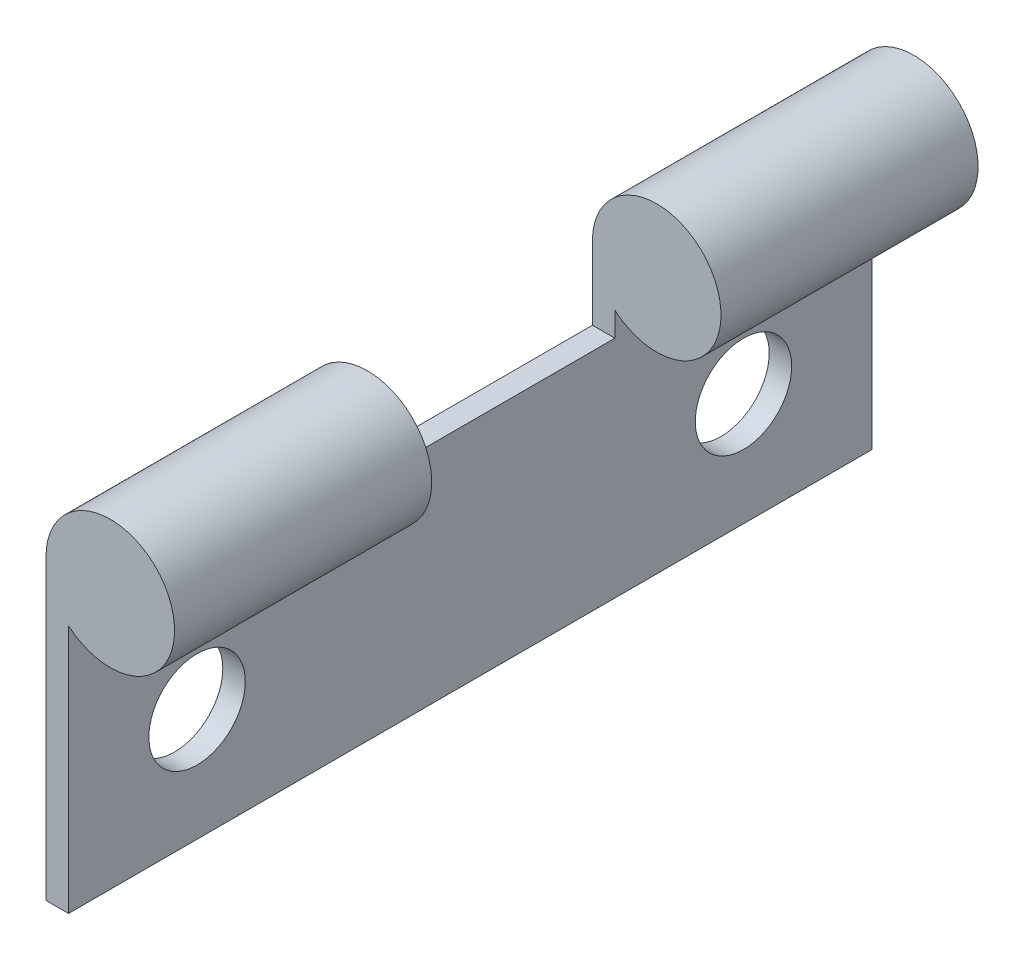
ISO-10303-21;
HEADER;
FILE_DESCRIPTION(('STEP AP214'),'2;1');
FILE_NAME('part.step','',(''),(''),'','','');
FILE_SCHEMA(('AUTOMOTIVE_DESIGN { 1 0 10303 214 1 1 1 1 }'));
ENDSEC;
DATA;
#1=APPLICATION_CONTEXT('core data for automotive mechanical design processes');
#2=APPLICATION_PROTOCOL_DEFINITION('international standard','automotive_design',2000,#1);
#3=PRODUCT_CONTEXT('',#1,'mechanical');
#4=PRODUCT('Part','Part','',(#3));
#5=PRODUCT_RELATED_PRODUCT_CATEGORY('part','',(#4));
#6=PRODUCT_DEFINITION_FORMATION('','',#4);
#7=PRODUCT_DEFINITION_CONTEXT('part definition',#1,'design');
#8=PRODUCT_DEFINITION('design','',#6,#7);
#9=PRODUCT_DEFINITION_SHAPE('','',#8);
#10=(LENGTH_UNIT() NAMED_UNIT(*) SI_UNIT(.MILLI.,.METRE.));
#11=(NAMED_UNIT(*) PLANE_ANGLE_UNIT() SI_UNIT($,.RADIAN.));
#12=(NAMED_UNIT(*) SI_UNIT($,.STERADIAN.) SOLID_ANGLE_UNIT());
#13=UNCERTAINTY_MEASURE_WITH_UNIT(LENGTH_MEASURE(1.E-05),#10,'distance_accuracy_value','');
#14=(GEOMETRIC_REPRESENTATION_CONTEXT(3) GLOBAL_UNCERTAINTY_ASSIGNED_CONTEXT((#13)) GLOBAL_UNIT_ASSIGNED_CONTEXT((#10,
#11,#12)) REPRESENTATION_CONTEXT('',''));
#15=CARTESIAN_POINT('',(0.,0.,0.));
#16=DIRECTION('',(0.,0.,1.));
#17=DIRECTION('',(1.,0.,0.));
#18=AXIS2_PLACEMENT_3D('',#15,#16,#17);
#19=CARTESIAN_POINT('',(0.7,0.,0.));
#20=DIRECTION('',(-1.,0.,0.));
#21=DIRECTION('',(0.,0.,1.));
#22=AXIS2_PLACEMENT_3D('',#19,#20,#21);
#23=PLANE('',#22);
#24=DIRECTION('',(0.,-1.,0.));
#25=VECTOR('',#24,1.);
#26=CARTESIAN_POINT('',(0.7,69.8482632675798,-185.963773135156));
#27=LINE('',#26,#25);
#28=CARTESIAN_POINT('',(0.699999999999995,68.3283948522228,-185.963773135156));
#29=VERTEX_POINT('',#28);
#30=CARTESIAN_POINT('',(0.7,60.5747220858746,-185.963773135156));
#31=VERTEX_POINT('',#30);
#32=EDGE_CURVE('E187',#29,#31,#27,.T.);
#33=ORIENTED_EDGE('',*,*,#32,.F.);
#34=DIRECTION('',(0.,0.,-1.));
#35=VECTOR('',#34,1.);
#36=CARTESIAN_POINT('',(0.7,68.3283948522228,-172.306918885664));
#37=LINE('',#36,#35);
#38=CARTESIAN_POINT('',(0.699999999999995,68.3283948522228,-177.963773135156));
#39=VERTEX_POINT('',#38);
#40=EDGE_CURVE('E172',#29,#39,#37,.F.);
#41=ORIENTED_EDGE('',*,*,#40,.T.);
#42=DIRECTION('',(0.,-1.,0.));
#43=VECTOR('',#42,1.);
#44=CARTESIAN_POINT('',(0.7,69.8482632675798,-177.963773135156));
#45=LINE('',#44,#43);
#46=CARTESIAN_POINT('',(0.7,67.5747220858746,-177.963773135156));
#47=VERTEX_POINT('',#46);
#48=EDGE_CURVE('E184',#39,#47,#45,.T.);
#49=ORIENTED_EDGE('',*,*,#48,.T.);
#50=DIRECTION('',(0.,0.,-1.));
#51=VECTOR('',#50,1.);
#52=CARTESIAN_POINT('',(0.7,67.5747220858746,-168.963773135156));
#53=LINE('',#52,#51);
#54=CARTESIAN_POINT('',(0.7,67.5747220858746,-168.963773135156));
#55=VERTEX_POINT('',#54);
#56=EDGE_CURVE('E193',#55,#47,#53,.T.);
#57=ORIENTED_EDGE('',*,*,#56,.F.);
#58=DIRECTION('',(0.,1.,0.));
#59=VECTOR('',#58,1.);
#60=CARTESIAN_POINT('',(0.7,67.5747220858746,-168.963773135156));
#61=LINE('',#60,#59);
#62=CARTESIAN_POINT('',(0.7,68.3283948522228,-168.963773135156));
#63=VERTEX_POINT('',#62);
#64=EDGE_CURVE('E127',#55,#63,#61,.T.);
#65=ORIENTED_EDGE('',*,*,#64,.T.);
#66=DIRECTION('',(0.,0.,1.));
#67=VECTOR('',#66,1.);
#68=CARTESIAN_POINT('',(0.7,68.3283948522228,-174.620627384649));
#69=LINE('',#68,#67);
#70=CARTESIAN_POINT('',(0.7,68.3283948522228,-160.963773135156));
#71=VERTEX_POINT('',#70);
#72=EDGE_CURVE('E122',#63,#71,#69,.T.);
#73=ORIENTED_EDGE('',*,*,#72,.T.);
#74=DIRECTION('',(0.,1.,0.));
#75=VECTOR('',#74,1.);
#76=CARTESIAN_POINT('',(0.7,67.5747220858746,-160.963773135156));
#77=LINE('',#76,#75);
#78=CARTESIAN_POINT('',(0.7,60.5747220858746,-160.963773135156));
#79=VERTEX_POINT('',#78);
#80=EDGE_CURVE('E222',#79,#71,#77,.T.);
#81=ORIENTED_EDGE('',*,*,#80,.F.);
#82=DIRECTION('',(0.,0.,1.));
#83=VECTOR('',#82,1.);
#84=CARTESIAN_POINT('',(0.7,60.5747220858746,-185.963773135156));
#85=LINE('',#84,#83);
#86=EDGE_CURVE('E195',#31,#79,#85,.T.);
#87=ORIENTED_EDGE('',*,*,#86,.F.);
#88=EDGE_LOOP('',(#33,#41,#49,#57,#65,#73,#81,#87));
#89=FACE_BOUND('',#88,.T.);
#90=CARTESIAN_POINT('',(0.7,64.0747220858746,-181.963773135156));
#91=DIRECTION('',(1.,0.,0.));
#92=DIRECTION('',(0.,0.,-1.));
#93=AXIS2_PLACEMENT_3D('',#90,#91,#92);
#94=CIRCLE('',#93,1.5);
#95=CARTESIAN_POINT('',(0.7,64.0747220858746,-183.463773135156));
#96=VERTEX_POINT('',#95);
#97=EDGE_CURVE('E205',#96,#96,#94,.T.);
#98=ORIENTED_EDGE('',*,*,#97,.F.);
#99=EDGE_LOOP('',(#98));
#100=FACE_BOUND('',#99,.T.);
#101=CARTESIAN_POINT('',(0.7,64.0747220858746,-164.963773135156));
#102=DIRECTION('',(1.,0.,0.));
#103=DIRECTION('',(0.,0.,-1.));
#104=AXIS2_PLACEMENT_3D('',#101,#102,#103);
#105=CIRCLE('',#104,1.5);
#106=CARTESIAN_POINT('',(0.7,64.0747220858746,-166.463773135156));
#107=VERTEX_POINT('',#106);
#108=EDGE_CURVE('E275',#107,#107,#105,.T.);
#109=ORIENTED_EDGE('',*,*,#108,.F.);
#110=EDGE_LOOP('',(#109));
#111=FACE_BOUND('',#110,.T.);
#112=ADVANCED_FACE('F105',(#89,#100,#111),#23,.F.);
#113=CARTESIAN_POINT('',(0.,0.,0.));
#114=DIRECTION('',(-1.,0.,0.));
#115=DIRECTION('',(0.,0.,1.));
#116=AXIS2_PLACEMENT_3D('',#113,#114,#115);
#117=PLANE('',#116);
#118=CARTESIAN_POINT('',(0.,64.0747220858746,-181.963773135156));
#119=DIRECTION('',(1.,0.,0.));
#120=DIRECTION('',(0.,0.,-1.));
#121=AXIS2_PLACEMENT_3D('',#118,#119,#120);
#122=CIRCLE('',#121,1.5);
#123=CARTESIAN_POINT('',(0.,64.0747220858746,-183.463773135156));
#124=VERTEX_POINT('',#123);
#125=EDGE_CURVE('E278',#124,#124,#122,.T.);
#126=ORIENTED_EDGE('',*,*,#125,.T.);
#127=EDGE_LOOP('',(#126));
#128=FACE_BOUND('',#127,.T.);
#129=DIRECTION('',(0.,-1.,0.));
#130=VECTOR('',#129,1.);
#131=CARTESIAN_POINT('',(0.,67.5747220858746,-160.963773135156));
#132=LINE('',#131,#130);
#133=CARTESIAN_POINT('',(0.,69.8482632675798,-160.963773135156));
#134=VERTEX_POINT('',#133);
#135=CARTESIAN_POINT('',(0.,60.5747220858746,-160.963773135156));
#136=VERTEX_POINT('',#135);
#137=EDGE_CURVE('E220',#134,#136,#132,.T.);
#138=ORIENTED_EDGE('',*,*,#137,.F.);
#139=DIRECTION('',(0.,0.,-1.));
#140=VECTOR('',#139,1.);
#141=CARTESIAN_POINT('',(0.,69.8482632675798,-160.963773135156));
#142=LINE('',#141,#140);
#143=CARTESIAN_POINT('',(0.,69.8482632675798,-168.963773135156));
#144=VERTEX_POINT('',#143);
#145=EDGE_CURVE('E202',#134,#144,#142,.T.);
#146=ORIENTED_EDGE('',*,*,#145,.T.);
#147=DIRECTION('',(0.,1.,0.));
#148=VECTOR('',#147,1.);
#149=CARTESIAN_POINT('',(0.,67.5747220858746,-168.963773135156));
#150=LINE('',#149,#148);
#151=CARTESIAN_POINT('',(0.,67.5747220858746,-168.963773135156));
#152=VERTEX_POINT('',#151);
#153=EDGE_CURVE('E204',#152,#144,#150,.T.);
#154=ORIENTED_EDGE('',*,*,#153,.F.);
#155=DIRECTION('',(0.,0.,-1.));
#156=VECTOR('',#155,1.);
#157=CARTESIAN_POINT('',(0.,67.5747220858746,-168.963773135156));
#158=LINE('',#157,#156);
#159=CARTESIAN_POINT('',(0.,67.5747220858746,-177.963773135156));
#160=VERTEX_POINT('',#159);
#161=EDGE_CURVE('E208',#152,#160,#158,.T.);
#162=ORIENTED_EDGE('',*,*,#161,.T.);
#163=DIRECTION('',(0.,-1.,0.));
#164=VECTOR('',#163,1.);
#165=CARTESIAN_POINT('',(0.,69.8482632675798,-177.963773135156));
#166=LINE('',#165,#164);
#167=CARTESIAN_POINT('',(0.,69.8482632675798,-177.963773135156));
#168=VERTEX_POINT('',#167);
#169=EDGE_CURVE('E211',#168,#160,#166,.T.);
#170=ORIENTED_EDGE('',*,*,#169,.F.);
#171=DIRECTION('',(0.,0.,-1.));
#172=VECTOR('',#171,1.);
#173=CARTESIAN_POINT('',(0.,69.8482632675798,-177.963773135156));
#174=LINE('',#173,#172);
#175=CARTESIAN_POINT('',(0.,69.8482632675798,-185.963773135156));
#176=VERTEX_POINT('',#175);
#177=EDGE_CURVE('E175',#168,#176,#174,.T.);
#178=ORIENTED_EDGE('',*,*,#177,.T.);
#179=DIRECTION('',(0.,-1.,0.));
#180=VECTOR('',#179,1.);
#181=CARTESIAN_POINT('',(0.,67.5747220858746,-185.963773135156));
#182=LINE('',#181,#180);
#183=CARTESIAN_POINT('',(0.,60.5747220858746,-185.963773135156));
#184=VERTEX_POINT('',#183);
#185=EDGE_CURVE('E214',#176,#184,#182,.T.);
#186=ORIENTED_EDGE('',*,*,#185,.T.);
#187=DIRECTION('',(0.,0.,1.));
#188=VECTOR('',#187,1.);
#189=CARTESIAN_POINT('',(0.,60.5747220858746,-185.963773135156));
#190=LINE('',#189,#188);
#191=EDGE_CURVE('E217',#184,#136,#190,.T.);
#192=ORIENTED_EDGE('',*,*,#191,.T.);
#193=EDGE_LOOP('',(#138,#146,#154,#162,#170,#178,#186,#192));
#194=FACE_BOUND('',#193,.T.);
#195=CARTESIAN_POINT('',(0.,64.0747220858746,-164.963773135156));
#196=DIRECTION('',(1.,0.,0.));
#197=DIRECTION('',(0.,0.,-1.));
#198=AXIS2_PLACEMENT_3D('',#195,#196,#197);
#199=CIRCLE('',#198,1.5);
#200=CARTESIAN_POINT('',(0.,64.0747220858746,-166.463773135156));
#201=VERTEX_POINT('',#200);
#202=EDGE_CURVE('E274',#201,#201,#199,.T.);
#203=ORIENTED_EDGE('',*,*,#202,.T.);
#204=EDGE_LOOP('',(#203));
#205=FACE_BOUND('',#204,.T.);
#206=ADVANCED_FACE('F231',(#128,#194,#205),#117,.T.);
#207=CARTESIAN_POINT('',(0.7,67.5747220858746,-160.963773135156));
#208=DIRECTION('',(0.,0.,-1.));
#209=DIRECTION('',(-1.,0.,0.));
#210=AXIS2_PLACEMENT_3D('',#207,#208,#209);
#211=PLANE('',#210);
#212=ORIENTED_EDGE('',*,*,#80,.T.);
#213=CARTESIAN_POINT('',(2.,69.8482632675798,-160.963773135156));
#214=DIRECTION('',(0.,0.,1.));
#215=DIRECTION('',(1.,0.,0.));
#216=AXIS2_PLACEMENT_3D('',#213,#214,#215);
#217=CIRCLE('',#216,2.);
#218=EDGE_CURVE('E188',#71,#134,#217,.T.);
#219=ORIENTED_EDGE('',*,*,#218,.T.);
#220=ORIENTED_EDGE('',*,*,#137,.T.);
#221=DIRECTION('',(-1.,0.,0.));
#222=VECTOR('',#221,1.);
#223=CARTESIAN_POINT('',(0.7,60.5747220858746,-160.963773135156));
#224=LINE('',#223,#222);
#225=EDGE_CURVE('E12',#79,#136,#224,.T.);
#226=ORIENTED_EDGE('',*,*,#225,.F.);
#227=EDGE_LOOP('',(#212,#219,#220,#226));
#228=FACE_BOUND('',#227,.T.);
#229=ADVANCED_FACE('F248',(#228),#211,.F.);
#230=CARTESIAN_POINT('',(0.7,60.5747220858746,-185.963773135156));
#231=DIRECTION('',(0.,-1.,0.));
#232=DIRECTION('',(0.,0.,-1.));
#233=AXIS2_PLACEMENT_3D('',#230,#231,#232);
#234=PLANE('',#233);
#235=ORIENTED_EDGE('',*,*,#191,.F.);
#236=DIRECTION('',(-1.,0.,0.));
#237=VECTOR('',#236,1.);
#238=CARTESIAN_POINT('',(0.7,60.5747220858746,-185.963773135156));
#239=LINE('',#238,#237);
#240=EDGE_CURVE('E114',#31,#184,#239,.T.);
#241=ORIENTED_EDGE('',*,*,#240,.F.);
#242=ORIENTED_EDGE('',*,*,#86,.T.);
#243=ORIENTED_EDGE('',*,*,#225,.T.);
#244=EDGE_LOOP('',(#235,#241,#242,#243));
#245=FACE_BOUND('',#244,.T.);
#246=ADVANCED_FACE('F256',(#245),#234,.T.);
#247=CARTESIAN_POINT('',(0.7,67.5747220858746,-185.963773135156));
#248=DIRECTION('',(0.,0.,-1.));
#249=DIRECTION('',(-1.,0.,0.));
#250=AXIS2_PLACEMENT_3D('',#247,#248,#249);
#251=PLANE('',#250);
#252=CARTESIAN_POINT('',(2.,69.8482632675798,-185.963773135156));
#253=DIRECTION('',(0.,0.,-1.));
#254=DIRECTION('',(-1.,0.,0.));
#255=AXIS2_PLACEMENT_3D('',#252,#253,#254);
#256=CIRCLE('',#255,2.);
#257=EDGE_CURVE('E180',#176,#29,#256,.T.);
#258=ORIENTED_EDGE('',*,*,#257,.T.);
#259=ORIENTED_EDGE('',*,*,#32,.T.);
#260=ORIENTED_EDGE('',*,*,#240,.T.);
#261=ORIENTED_EDGE('',*,*,#185,.F.);
#262=EDGE_LOOP('',(#258,#259,#260,#261));
#263=FACE_BOUND('',#262,.T.);
#264=ADVANCED_FACE('F241',(#263),#251,.T.);
#265=CARTESIAN_POINT('',(0.7,69.8482632675798,-177.963773135156));
#266=DIRECTION('',(0.,0.,-1.));
#267=DIRECTION('',(-1.,0.,0.));
#268=AXIS2_PLACEMENT_3D('',#265,#266,#267);
#269=PLANE('',#268);
#270=ORIENTED_EDGE('',*,*,#48,.F.);
#271=CARTESIAN_POINT('',(2.,69.8482632675798,-177.963773135156));
#272=DIRECTION('',(0.,0.,-1.));
#273=DIRECTION('',(-1.,0.,0.));
#274=AXIS2_PLACEMENT_3D('',#271,#272,#273);
#275=CIRCLE('',#274,2.);
#276=EDGE_CURVE('E169',#39,#168,#275,.F.);
#277=ORIENTED_EDGE('',*,*,#276,.T.);
#278=ORIENTED_EDGE('',*,*,#169,.T.);
#279=DIRECTION('',(-1.,0.,0.));
#280=VECTOR('',#279,1.);
#281=CARTESIAN_POINT('',(0.7,67.5747220858746,-177.963773135156));
#282=LINE('',#281,#280);
#283=EDGE_CURVE('E191',#47,#160,#282,.T.);
#284=ORIENTED_EDGE('',*,*,#283,.F.);
#285=EDGE_LOOP('',(#270,#277,#278,#284));
#286=FACE_BOUND('',#285,.T.);
#287=ADVANCED_FACE('F190',(#286),#269,.F.);
#288=CARTESIAN_POINT('',(0.7,67.5747220858746,-168.963773135156));
#289=DIRECTION('',(0.,1.,0.));
#290=DIRECTION('',(0.,0.,1.));
#291=AXIS2_PLACEMENT_3D('',#288,#289,#290);
#292=PLANE('',#291);
#293=ORIENTED_EDGE('',*,*,#161,.F.);
#294=DIRECTION('',(-1.,0.,0.));
#295=VECTOR('',#294,1.);
#296=CARTESIAN_POINT('',(0.7,67.5747220858746,-168.963773135156));
#297=LINE('',#296,#295);
#298=EDGE_CURVE('E109',#55,#152,#297,.T.);
#299=ORIENTED_EDGE('',*,*,#298,.F.);
#300=ORIENTED_EDGE('',*,*,#56,.T.);
#301=ORIENTED_EDGE('',*,*,#283,.T.);
#302=EDGE_LOOP('',(#293,#299,#300,#301));
#303=FACE_BOUND('',#302,.T.);
#304=ADVANCED_FACE('F234',(#303),#292,.T.);
#305=CARTESIAN_POINT('',(0.7,67.5747220858746,-168.963773135156));
#306=DIRECTION('',(0.,0.,1.));
#307=DIRECTION('',(1.,0.,0.));
#308=AXIS2_PLACEMENT_3D('',#305,#306,#307);
#309=PLANE('',#308);
#310=ORIENTED_EDGE('',*,*,#153,.T.);
#311=CARTESIAN_POINT('',(2.,69.8482632675798,-168.963773135156));
#312=DIRECTION('',(0.,0.,1.));
#313=DIRECTION('',(1.,0.,0.));
#314=AXIS2_PLACEMENT_3D('',#311,#312,#313);
#315=CIRCLE('',#314,2.);
#316=EDGE_CURVE('E271',#144,#63,#315,.F.);
#317=ORIENTED_EDGE('',*,*,#316,.T.);
#318=ORIENTED_EDGE('',*,*,#64,.F.);
#319=ORIENTED_EDGE('',*,*,#298,.T.);
#320=EDGE_LOOP('',(#310,#317,#318,#319));
#321=FACE_BOUND('',#320,.T.);
#322=ADVANCED_FACE('F107',(#321),#309,.F.);
#323=CARTESIAN_POINT('',(0.7,64.0747220858746,-181.963773135156));
#324=DIRECTION('',(-1.,0.,0.));
#325=DIRECTION('',(0.,0.,1.));
#326=AXIS2_PLACEMENT_3D('',#323,#324,#325);
#327=CYLINDRICAL_SURFACE('',#326,1.5);
#328=ORIENTED_EDGE('',*,*,#97,.T.);
#329=EDGE_LOOP('',(#328));
#330=FACE_BOUND('',#329,.T.);
#331=ORIENTED_EDGE('',*,*,#125,.F.);
#332=EDGE_LOOP('',(#331));
#333=FACE_BOUND('',#332,.T.);
#334=ADVANCED_FACE('F240',(#330,#333),#327,.F.);
#335=CARTESIAN_POINT('',(0.7,64.0747220858746,-164.963773135156));
#336=DIRECTION('',(-1.,0.,0.));
#337=DIRECTION('',(0.,0.,1.));
#338=AXIS2_PLACEMENT_3D('',#335,#336,#337);
#339=CYLINDRICAL_SURFACE('',#338,1.5);
#340=ORIENTED_EDGE('',*,*,#108,.T.);
#341=EDGE_LOOP('',(#340));
#342=FACE_BOUND('',#341,.T.);
#343=ORIENTED_EDGE('',*,*,#202,.F.);
#344=EDGE_LOOP('',(#343));
#345=FACE_BOUND('',#344,.T.);
#346=ADVANCED_FACE('F290',(#342,#345),#339,.F.);
#347=CARTESIAN_POINT('',(2.,69.8482632675798,-174.620627384649));
#348=DIRECTION('',(0.,0.,1.));
#349=DIRECTION('',(1.,0.,0.));
#350=AXIS2_PLACEMENT_3D('',#347,#348,#349);
#351=CYLINDRICAL_SURFACE('',#350,2.);
#352=ORIENTED_EDGE('',*,*,#72,.F.);
#353=ORIENTED_EDGE('',*,*,#316,.F.);
#354=ORIENTED_EDGE('',*,*,#145,.F.);
#355=ORIENTED_EDGE('',*,*,#218,.F.);
#356=EDGE_LOOP('',(#352,#353,#354,#355));
#357=FACE_BOUND('',#356,.T.);
#358=ADVANCED_FACE('F288',(#357),#351,.T.);
#359=CARTESIAN_POINT('',(2.,69.8482632675798,-172.306918885664));
#360=DIRECTION('',(0.,0.,-1.));
#361=DIRECTION('',(-1.,0.,0.));
#362=AXIS2_PLACEMENT_3D('',#359,#360,#361);
#363=CYLINDRICAL_SURFACE('',#362,2.);
#364=ORIENTED_EDGE('',*,*,#40,.F.);
#365=ORIENTED_EDGE('',*,*,#257,.F.);
#366=ORIENTED_EDGE('',*,*,#177,.F.);
#367=ORIENTED_EDGE('',*,*,#276,.F.);
#368=EDGE_LOOP('',(#364,#365,#366,#367));
#369=FACE_BOUND('',#368,.T.);
#370=ADVANCED_FACE('F171',(#369),#363,.T.);
#371=CLOSED_SHELL('',(#112,#206,#229,#246,#264,#287,#304,#322,#334,#346,#358,#370));
#372=MANIFOLD_SOLID_BREP('B2',#371);
#373=ADVANCED_BREP_SHAPE_REPRESENTATION('',(#18,#372),#14);
#374=SHAPE_DEFINITION_REPRESENTATION(#9,#373);
ENDSEC;
END-ISO-10303-21;
